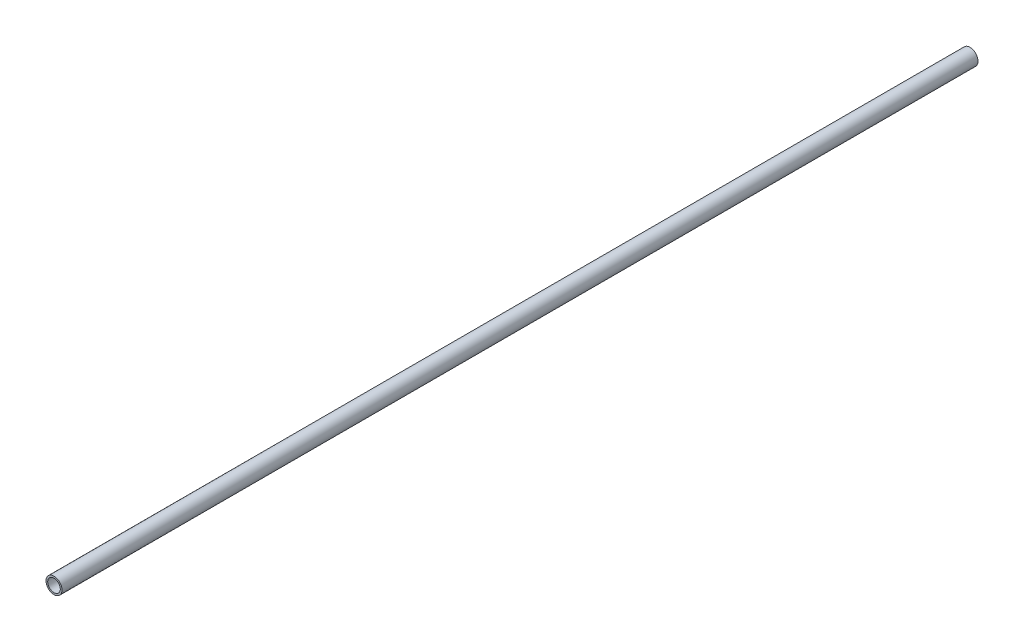
ISO-10303-21;
HEADER;
FILE_DESCRIPTION(('STEP AP214'),'2;1');
FILE_NAME('part.step','',(''),(''),'','','');
FILE_SCHEMA(('AUTOMOTIVE_DESIGN { 1 0 10303 214 1 1 1 1 }'));
ENDSEC;
DATA;
#1=APPLICATION_CONTEXT('core data for automotive mechanical design processes');
#2=APPLICATION_PROTOCOL_DEFINITION('international standard','automotive_design',2000,#1);
#3=PRODUCT_CONTEXT('',#1,'mechanical');
#4=PRODUCT('Part','Part','',(#3));
#5=PRODUCT_RELATED_PRODUCT_CATEGORY('part','',(#4));
#6=PRODUCT_DEFINITION_FORMATION('','',#4);
#7=PRODUCT_DEFINITION_CONTEXT('part definition',#1,'design');
#8=PRODUCT_DEFINITION('design','',#6,#7);
#9=PRODUCT_DEFINITION_SHAPE('','',#8);
#10=(LENGTH_UNIT() NAMED_UNIT(*) SI_UNIT(.MILLI.,.METRE.));
#11=(NAMED_UNIT(*) PLANE_ANGLE_UNIT() SI_UNIT($,.RADIAN.));
#12=(NAMED_UNIT(*) SI_UNIT($,.STERADIAN.) SOLID_ANGLE_UNIT());
#13=UNCERTAINTY_MEASURE_WITH_UNIT(LENGTH_MEASURE(1.E-05),#10,'distance_accuracy_value','');
#14=(GEOMETRIC_REPRESENTATION_CONTEXT(3) GLOBAL_UNCERTAINTY_ASSIGNED_CONTEXT((#13)) GLOBAL_UNIT_ASSIGNED_CONTEXT((#10,
#11,#12)) REPRESENTATION_CONTEXT('',''));
#15=CARTESIAN_POINT('',(0.,0.,0.));
#16=DIRECTION('',(0.,0.,1.));
#17=DIRECTION('',(1.,0.,0.));
#18=AXIS2_PLACEMENT_3D('',#15,#16,#17);
#19=CARTESIAN_POINT('',(0.,0.,762.));
#20=DIRECTION('',(0.,0.,1.));
#21=DIRECTION('',(1.,0.,0.));
#22=AXIS2_PLACEMENT_3D('',#19,#20,#21);
#23=PLANE('',#22);
#24=CARTESIAN_POINT('',(0.,0.,762.));
#25=DIRECTION('',(0.,0.,1.));
#26=DIRECTION('',(1.,0.,0.));
#27=AXIS2_PLACEMENT_3D('',#24,#25,#26);
#28=CIRCLE('',#27,13.335);
#29=CARTESIAN_POINT('',(13.335,0.,762.));
#30=VERTEX_POINT('',#29);
#31=EDGE_CURVE('E11',#30,#30,#28,.T.);
#32=ORIENTED_EDGE('',*,*,#31,.T.);
#33=EDGE_LOOP('',(#32));
#34=FACE_BOUND('',#33,.T.);
#35=CARTESIAN_POINT('',(0.,0.,762.));
#36=DIRECTION('',(0.,0.,1.));
#37=DIRECTION('',(1.,0.,0.));
#38=AXIS2_PLACEMENT_3D('',#35,#36,#37);
#39=CIRCLE('',#38,10.4648);
#40=CARTESIAN_POINT('',(10.4648,0.,762.));
#41=VERTEX_POINT('',#40);
#42=EDGE_CURVE('E47',#41,#41,#39,.T.);
#43=ORIENTED_EDGE('',*,*,#42,.F.);
#44=EDGE_LOOP('',(#43));
#45=FACE_BOUND('',#44,.T.);
#46=ADVANCED_FACE('F36',(#34,#45),#23,.T.);
#47=CARTESIAN_POINT('',(0.,0.,-762.));
#48=DIRECTION('',(0.,0.,1.));
#49=DIRECTION('',(1.,0.,0.));
#50=AXIS2_PLACEMENT_3D('',#47,#48,#49);
#51=PLANE('',#50);
#52=CARTESIAN_POINT('',(0.,0.,-762.));
#53=DIRECTION('',(0.,0.,1.));
#54=DIRECTION('',(1.,0.,0.));
#55=AXIS2_PLACEMENT_3D('',#52,#53,#54);
#56=CIRCLE('',#55,13.335);
#57=CARTESIAN_POINT('',(13.335,0.,-762.));
#58=VERTEX_POINT('',#57);
#59=EDGE_CURVE('E40',#58,#58,#56,.T.);
#60=ORIENTED_EDGE('',*,*,#59,.F.);
#61=EDGE_LOOP('',(#60));
#62=FACE_BOUND('',#61,.T.);
#63=CARTESIAN_POINT('',(0.,0.,-762.));
#64=DIRECTION('',(0.,0.,1.));
#65=DIRECTION('',(1.,0.,0.));
#66=AXIS2_PLACEMENT_3D('',#63,#64,#65);
#67=CIRCLE('',#66,10.4648);
#68=CARTESIAN_POINT('',(10.4648,0.,-762.));
#69=VERTEX_POINT('',#68);
#70=EDGE_CURVE('E49',#69,#69,#67,.T.);
#71=ORIENTED_EDGE('',*,*,#70,.T.);
#72=EDGE_LOOP('',(#71));
#73=FACE_BOUND('',#72,.T.);
#74=ADVANCED_FACE('F59',(#62,#73),#51,.F.);
#75=CARTESIAN_POINT('',(0.,0.,762.));
#76=DIRECTION('',(0.,0.,-1.));
#77=DIRECTION('',(-1.,0.,0.));
#78=AXIS2_PLACEMENT_3D('',#75,#76,#77);
#79=CYLINDRICAL_SURFACE('',#78,13.335);
#80=ORIENTED_EDGE('',*,*,#31,.F.);
#81=EDGE_LOOP('',(#80));
#82=FACE_BOUND('',#81,.T.);
#83=ORIENTED_EDGE('',*,*,#59,.T.);
#84=EDGE_LOOP('',(#83));
#85=FACE_BOUND('',#84,.T.);
#86=ADVANCED_FACE('F38',(#82,#85),#79,.T.);
#87=CARTESIAN_POINT('',(0.,0.,762.));
#88=DIRECTION('',(0.,0.,-1.));
#89=DIRECTION('',(-1.,0.,0.));
#90=AXIS2_PLACEMENT_3D('',#87,#88,#89);
#91=CYLINDRICAL_SURFACE('',#90,10.4648);
#92=ORIENTED_EDGE('',*,*,#42,.T.);
#93=EDGE_LOOP('',(#92));
#94=FACE_BOUND('',#93,.T.);
#95=ORIENTED_EDGE('',*,*,#70,.F.);
#96=EDGE_LOOP('',(#95));
#97=FACE_BOUND('',#96,.T.);
#98=ADVANCED_FACE('F55',(#94,#97),#91,.F.);
#99=CLOSED_SHELL('',(#46,#74,#86,#98));
#100=MANIFOLD_SOLID_BREP('B2',#99);
#101=ADVANCED_BREP_SHAPE_REPRESENTATION('',(#18,#100),#14);
#102=SHAPE_DEFINITION_REPRESENTATION(#9,#101);
ENDSEC;
END-ISO-10303-21;
